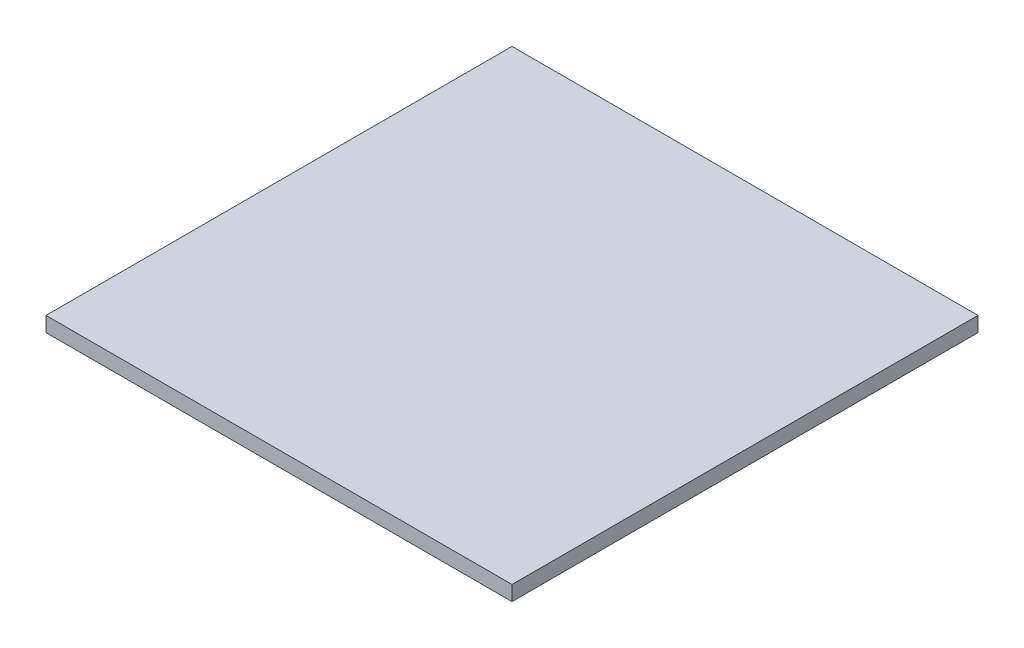
ISO-10303-21;
HEADER;
FILE_DESCRIPTION(('STEP AP214'),'2;1');
FILE_NAME('part.step','',(''),(''),'','','');
FILE_SCHEMA(('AUTOMOTIVE_DESIGN { 1 0 10303 214 1 1 1 1 }'));
ENDSEC;
DATA;
#1=APPLICATION_CONTEXT('core data for automotive mechanical design processes');
#2=APPLICATION_PROTOCOL_DEFINITION('international standard','automotive_design',2000,#1);
#3=PRODUCT_CONTEXT('',#1,'mechanical');
#4=PRODUCT('Part','Part','',(#3));
#5=PRODUCT_RELATED_PRODUCT_CATEGORY('part','',(#4));
#6=PRODUCT_DEFINITION_FORMATION('','',#4);
#7=PRODUCT_DEFINITION_CONTEXT('part definition',#1,'design');
#8=PRODUCT_DEFINITION('design','',#6,#7);
#9=PRODUCT_DEFINITION_SHAPE('','',#8);
#10=(LENGTH_UNIT() NAMED_UNIT(*) SI_UNIT(.MILLI.,.METRE.));
#11=(NAMED_UNIT(*) PLANE_ANGLE_UNIT() SI_UNIT($,.RADIAN.));
#12=(NAMED_UNIT(*) SI_UNIT($,.STERADIAN.) SOLID_ANGLE_UNIT());
#13=UNCERTAINTY_MEASURE_WITH_UNIT(LENGTH_MEASURE(1.E-05),#10,'distance_accuracy_value','');
#14=(GEOMETRIC_REPRESENTATION_CONTEXT(3) GLOBAL_UNCERTAINTY_ASSIGNED_CONTEXT((#13)) GLOBAL_UNIT_ASSIGNED_CONTEXT((#10,
#11,#12)) REPRESENTATION_CONTEXT('',''));
#15=CARTESIAN_POINT('',(0.,0.,0.));
#16=DIRECTION('',(0.,0.,1.));
#17=DIRECTION('',(1.,0.,0.));
#18=AXIS2_PLACEMENT_3D('',#15,#16,#17);
#19=CARTESIAN_POINT('',(50.,197.,50.));
#20=DIRECTION('',(0.,1.,0.));
#21=DIRECTION('',(1.,0.,0.));
#22=AXIS2_PLACEMENT_3D('',#19,#20,#21);
#23=PLANE('',#22);
#24=DIRECTION('',(1.,0.,0.));
#25=VECTOR('',#24,1.);
#26=CARTESIAN_POINT('',(3.,197.,97.));
#27=LINE('',#26,#25);
#28=CARTESIAN_POINT('',(3.,197.,97.));
#29=VERTEX_POINT('',#28);
#30=CARTESIAN_POINT('',(97.,197.,97.));
#31=VERTEX_POINT('',#30);
#32=EDGE_CURVE('E28',#29,#31,#27,.T.);
#33=ORIENTED_EDGE('',*,*,#32,.F.);
#34=DIRECTION('',(0.,0.,1.));
#35=VECTOR('',#34,1.);
#36=CARTESIAN_POINT('',(3.,197.,3.));
#37=LINE('',#36,#35);
#38=CARTESIAN_POINT('',(3.,197.,3.));
#39=VERTEX_POINT('',#38);
#40=EDGE_CURVE('E21',#39,#29,#37,.T.);
#41=ORIENTED_EDGE('',*,*,#40,.F.);
#42=DIRECTION('',(-1.,0.,0.));
#43=VECTOR('',#42,1.);
#44=CARTESIAN_POINT('',(97.,197.,3.));
#45=LINE('',#44,#43);
#46=CARTESIAN_POINT('',(97.,197.,3.));
#47=VERTEX_POINT('',#46);
#48=EDGE_CURVE('E89',#47,#39,#45,.T.);
#49=ORIENTED_EDGE('',*,*,#48,.F.);
#50=DIRECTION('',(0.,0.,-1.));
#51=VECTOR('',#50,1.);
#52=CARTESIAN_POINT('',(97.,197.,97.));
#53=LINE('',#52,#51);
#54=EDGE_CURVE('E74',#31,#47,#53,.T.);
#55=ORIENTED_EDGE('',*,*,#54,.F.);
#56=EDGE_LOOP('',(#33,#41,#49,#55));
#57=FACE_BOUND('',#56,.T.);
#58=ADVANCED_FACE('F17',(#57),#23,.F.);
#59=CARTESIAN_POINT('',(50.,200.,50.));
#60=DIRECTION('',(0.,1.,0.));
#61=DIRECTION('',(1.,0.,0.));
#62=AXIS2_PLACEMENT_3D('',#59,#60,#61);
#63=PLANE('',#62);
#64=DIRECTION('',(1.,0.,0.));
#65=VECTOR('',#64,1.);
#66=CARTESIAN_POINT('',(3.,200.,97.));
#67=LINE('',#66,#65);
#68=CARTESIAN_POINT('',(3.,200.,97.));
#69=VERTEX_POINT('',#68);
#70=CARTESIAN_POINT('',(97.,200.,97.));
#71=VERTEX_POINT('',#70);
#72=EDGE_CURVE('E11',#69,#71,#67,.T.);
#73=ORIENTED_EDGE('',*,*,#72,.T.);
#74=DIRECTION('',(0.,0.,-1.));
#75=VECTOR('',#74,1.);
#76=CARTESIAN_POINT('',(97.,200.,97.));
#77=LINE('',#76,#75);
#78=CARTESIAN_POINT('',(97.,200.,3.));
#79=VERTEX_POINT('',#78);
#80=EDGE_CURVE('E64',#71,#79,#77,.T.);
#81=ORIENTED_EDGE('',*,*,#80,.T.);
#82=DIRECTION('',(-1.,0.,0.));
#83=VECTOR('',#82,1.);
#84=CARTESIAN_POINT('',(97.,200.,3.));
#85=LINE('',#84,#83);
#86=CARTESIAN_POINT('',(3.,200.,3.));
#87=VERTEX_POINT('',#86);
#88=EDGE_CURVE('E68',#79,#87,#85,.T.);
#89=ORIENTED_EDGE('',*,*,#88,.T.);
#90=DIRECTION('',(0.,0.,1.));
#91=VECTOR('',#90,1.);
#92=CARTESIAN_POINT('',(3.,200.,3.));
#93=LINE('',#92,#91);
#94=EDGE_CURVE('E100',#87,#69,#93,.T.);
#95=ORIENTED_EDGE('',*,*,#94,.T.);
#96=EDGE_LOOP('',(#73,#81,#89,#95));
#97=FACE_BOUND('',#96,.T.);
#98=ADVANCED_FACE('F66',(#97),#63,.T.);
#99=CARTESIAN_POINT('',(3.,197.,97.));
#100=DIRECTION('',(0.,0.,1.));
#101=DIRECTION('',(1.,0.,0.));
#102=AXIS2_PLACEMENT_3D('',#99,#100,#101);
#103=PLANE('',#102);
#104=ORIENTED_EDGE('',*,*,#32,.T.);
#105=DIRECTION('',(0.,1.,0.));
#106=VECTOR('',#105,1.);
#107=CARTESIAN_POINT('',(97.,197.,97.));
#108=LINE('',#107,#106);
#109=EDGE_CURVE('E73',#31,#71,#108,.T.);
#110=ORIENTED_EDGE('',*,*,#109,.T.);
#111=ORIENTED_EDGE('',*,*,#72,.F.);
#112=DIRECTION('',(0.,1.,0.));
#113=VECTOR('',#112,1.);
#114=CARTESIAN_POINT('',(3.,197.,97.));
#115=LINE('',#114,#113);
#116=EDGE_CURVE('E107',#29,#69,#115,.T.);
#117=ORIENTED_EDGE('',*,*,#116,.F.);
#118=EDGE_LOOP('',(#104,#110,#111,#117));
#119=FACE_BOUND('',#118,.T.);
#120=ADVANCED_FACE('F164',(#119),#103,.T.);
#121=CARTESIAN_POINT('',(97.,197.,97.));
#122=DIRECTION('',(1.,0.,0.));
#123=DIRECTION('',(0.,1.,0.));
#124=AXIS2_PLACEMENT_3D('',#121,#122,#123);
#125=PLANE('',#124);
#126=ORIENTED_EDGE('',*,*,#54,.T.);
#127=DIRECTION('',(0.,1.,0.));
#128=VECTOR('',#127,1.);
#129=CARTESIAN_POINT('',(97.,197.,3.));
#130=LINE('',#129,#128);
#131=EDGE_CURVE('E77',#47,#79,#130,.T.);
#132=ORIENTED_EDGE('',*,*,#131,.T.);
#133=ORIENTED_EDGE('',*,*,#80,.F.);
#134=ORIENTED_EDGE('',*,*,#109,.F.);
#135=EDGE_LOOP('',(#126,#132,#133,#134));
#136=FACE_BOUND('',#135,.T.);
#137=ADVANCED_FACE('F19',(#136),#125,.T.);
#138=CARTESIAN_POINT('',(97.,197.,3.));
#139=DIRECTION('',(0.,0.,-1.));
#140=DIRECTION('',(0.,-1.,0.));
#141=AXIS2_PLACEMENT_3D('',#138,#139,#140);
#142=PLANE('',#141);
#143=ORIENTED_EDGE('',*,*,#48,.T.);
#144=DIRECTION('',(0.,1.,0.));
#145=VECTOR('',#144,1.);
#146=CARTESIAN_POINT('',(3.,197.,3.));
#147=LINE('',#146,#145);
#148=EDGE_CURVE('E86',#39,#87,#147,.T.);
#149=ORIENTED_EDGE('',*,*,#148,.T.);
#150=ORIENTED_EDGE('',*,*,#88,.F.);
#151=ORIENTED_EDGE('',*,*,#131,.F.);
#152=EDGE_LOOP('',(#143,#149,#150,#151));
#153=FACE_BOUND('',#152,.T.);
#154=ADVANCED_FACE('F84',(#153),#142,.T.);
#155=CARTESIAN_POINT('',(3.,197.,3.));
#156=DIRECTION('',(-1.,0.,0.));
#157=DIRECTION('',(0.,0.,1.));
#158=AXIS2_PLACEMENT_3D('',#155,#156,#157);
#159=PLANE('',#158);
#160=ORIENTED_EDGE('',*,*,#40,.T.);
#161=ORIENTED_EDGE('',*,*,#116,.T.);
#162=ORIENTED_EDGE('',*,*,#94,.F.);
#163=ORIENTED_EDGE('',*,*,#148,.F.);
#164=EDGE_LOOP('',(#160,#161,#162,#163));
#165=FACE_BOUND('',#164,.T.);
#166=ADVANCED_FACE('F119',(#165),#159,.T.);
#167=CLOSED_SHELL('',(#58,#98,#120,#137,#154,#166));
#168=MANIFOLD_SOLID_BREP('B1',#167);
#169=ADVANCED_BREP_SHAPE_REPRESENTATION('',(#18,#168),#14);
#170=SHAPE_DEFINITION_REPRESENTATION(#9,#169);
ENDSEC;
END-ISO-10303-21;
